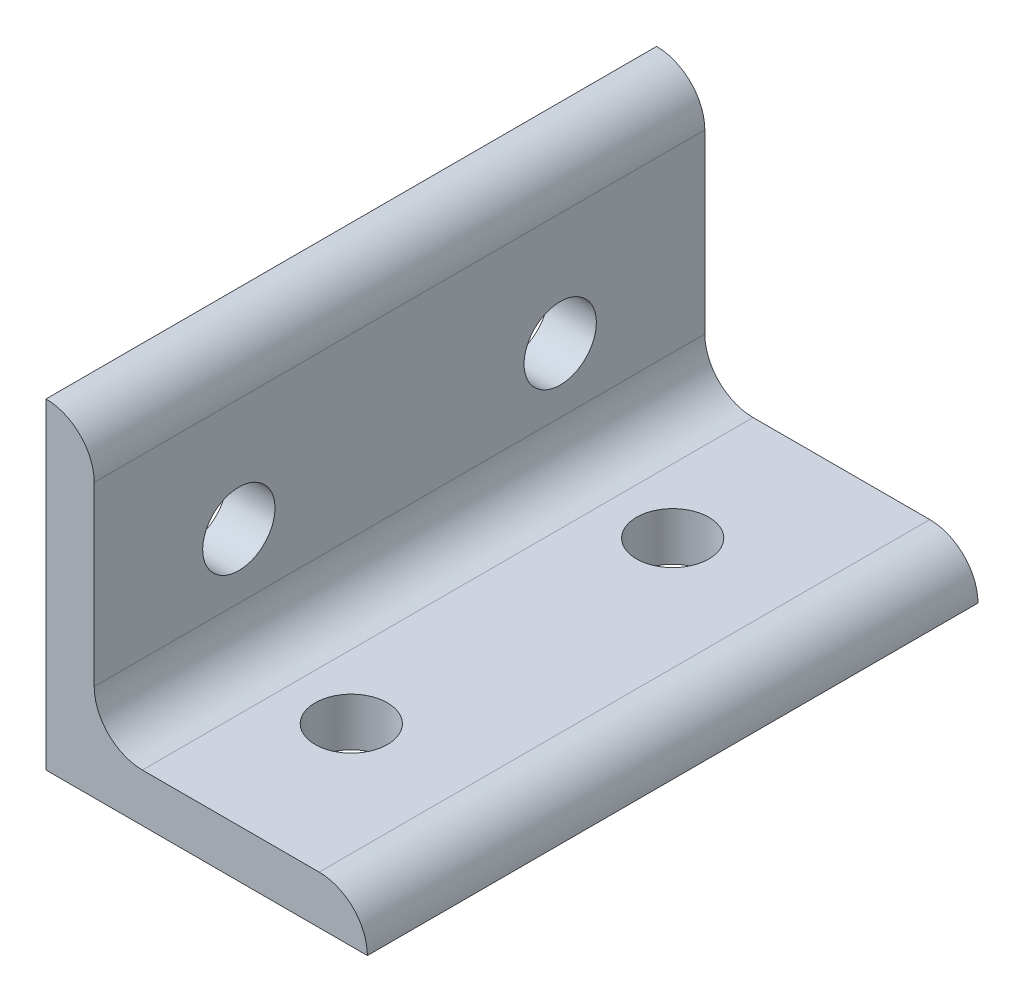
ISO-10303-21;
HEADER;
FILE_DESCRIPTION(('STEP AP214'),'2;1');
FILE_NAME('part.step','',(''),(''),'','','');
FILE_SCHEMA(('AUTOMOTIVE_DESIGN { 1 0 10303 214 1 1 1 1 }'));
ENDSEC;
DATA;
#1=APPLICATION_CONTEXT('core data for automotive mechanical design processes');
#2=APPLICATION_PROTOCOL_DEFINITION('international standard','automotive_design',2000,#1);
#3=PRODUCT_CONTEXT('',#1,'mechanical');
#4=PRODUCT('Part','Part','',(#3));
#5=PRODUCT_RELATED_PRODUCT_CATEGORY('part','',(#4));
#6=PRODUCT_DEFINITION_FORMATION('','',#4);
#7=PRODUCT_DEFINITION_CONTEXT('part definition',#1,'design');
#8=PRODUCT_DEFINITION('design','',#6,#7);
#9=PRODUCT_DEFINITION_SHAPE('','',#8);
#10=(LENGTH_UNIT() NAMED_UNIT(*) SI_UNIT(.MILLI.,.METRE.));
#11=(NAMED_UNIT(*) PLANE_ANGLE_UNIT() SI_UNIT($,.RADIAN.));
#12=(NAMED_UNIT(*) SI_UNIT($,.STERADIAN.) SOLID_ANGLE_UNIT());
#13=UNCERTAINTY_MEASURE_WITH_UNIT(LENGTH_MEASURE(1.E-05),#10,'distance_accuracy_value','');
#14=(GEOMETRIC_REPRESENTATION_CONTEXT(3) GLOBAL_UNCERTAINTY_ASSIGNED_CONTEXT((#13)) GLOBAL_UNIT_ASSIGNED_CONTEXT((#10,
#11,#12)) REPRESENTATION_CONTEXT('',''));
#15=CARTESIAN_POINT('',(0.,0.,0.));
#16=DIRECTION('',(0.,0.,1.));
#17=DIRECTION('',(1.,0.,0.));
#18=AXIS2_PLACEMENT_3D('',#15,#16,#17);
#19=CARTESIAN_POINT('',(6.,34.,38.));
#20=DIRECTION('',(-1.,0.,0.));
#21=DIRECTION('',(0.,-1.,0.));
#22=AXIS2_PLACEMENT_3D('',#19,#20,#21);
#23=PLANE('',#22);
#24=CARTESIAN_POINT('',(6.,20.,20.));
#25=DIRECTION('',(-1.,0.,0.));
#26=DIRECTION('',(0.,-1.,0.));
#27=AXIS2_PLACEMENT_3D('',#24,#25,#26);
#28=CIRCLE('',#27,4.5);
#29=CARTESIAN_POINT('',(6.,15.5,20.));
#30=VERTEX_POINT('',#29);
#31=EDGE_CURVE('E194',#30,#30,#28,.F.);
#32=ORIENTED_EDGE('',*,*,#31,.F.);
#33=EDGE_LOOP('',(#32));
#34=FACE_BOUND('',#33,.T.);
#35=DIRECTION('',(0.,1.,0.));
#36=VECTOR('',#35,1.);
#37=CARTESIAN_POINT('',(6.,34.,-38.));
#38=LINE('',#37,#36);
#39=CARTESIAN_POINT('',(6.,12.,-38.));
#40=VERTEX_POINT('',#39);
#41=CARTESIAN_POINT('',(6.,34.,-38.));
#42=VERTEX_POINT('',#41);
#43=EDGE_CURVE('E115',#40,#42,#38,.T.);
#44=ORIENTED_EDGE('',*,*,#43,.T.);
#45=DIRECTION('',(0.,0.,-1.));
#46=VECTOR('',#45,1.);
#47=CARTESIAN_POINT('',(6.,34.,38.));
#48=LINE('',#47,#46);
#49=CARTESIAN_POINT('',(6.,34.,38.));
#50=VERTEX_POINT('',#49);
#51=EDGE_CURVE('E112',#50,#42,#48,.T.);
#52=ORIENTED_EDGE('',*,*,#51,.F.);
#53=DIRECTION('',(0.,1.,0.));
#54=VECTOR('',#53,1.);
#55=CARTESIAN_POINT('',(6.,34.,38.));
#56=LINE('',#55,#54);
#57=CARTESIAN_POINT('',(6.,12.,38.));
#58=VERTEX_POINT('',#57);
#59=EDGE_CURVE('E101',#58,#50,#56,.T.);
#60=ORIENTED_EDGE('',*,*,#59,.F.);
#61=DIRECTION('',(0.,0.,-1.));
#62=VECTOR('',#61,1.);
#63=CARTESIAN_POINT('',(6.,12.,38.));
#64=LINE('',#63,#62);
#65=EDGE_CURVE('E116',#58,#40,#64,.T.);
#66=ORIENTED_EDGE('',*,*,#65,.T.);
#67=EDGE_LOOP('',(#44,#52,#60,#66));
#68=FACE_BOUND('',#67,.T.);
#69=CARTESIAN_POINT('',(6.,20.,-20.));
#70=DIRECTION('',(-1.,0.,0.));
#71=DIRECTION('',(0.,-1.,0.));
#72=AXIS2_PLACEMENT_3D('',#69,#70,#71);
#73=CIRCLE('',#72,4.5);
#74=CARTESIAN_POINT('',(6.,15.5,-20.));
#75=VERTEX_POINT('',#74);
#76=EDGE_CURVE('E187',#75,#75,#73,.F.);
#77=ORIENTED_EDGE('',*,*,#76,.F.);
#78=EDGE_LOOP('',(#77));
#79=FACE_BOUND('',#78,.T.);
#80=ADVANCED_FACE('F32',(#34,#68,#79),#23,.F.);
#81=CARTESIAN_POINT('',(0.,0.,38.));
#82=DIRECTION('',(1.,0.,0.));
#83=DIRECTION('',(0.,0.,-1.));
#84=AXIS2_PLACEMENT_3D('',#81,#82,#83);
#85=PLANE('',#84);
#86=CARTESIAN_POINT('',(0.,20.,20.));
#87=DIRECTION('',(1.,0.,0.));
#88=DIRECTION('',(0.,0.,-1.));
#89=AXIS2_PLACEMENT_3D('',#86,#87,#88);
#90=CIRCLE('',#89,4.5);
#91=CARTESIAN_POINT('',(0.,20.,15.5));
#92=VERTEX_POINT('',#91);
#93=EDGE_CURVE('E190',#92,#92,#90,.T.);
#94=ORIENTED_EDGE('',*,*,#93,.T.);
#95=EDGE_LOOP('',(#94));
#96=FACE_BOUND('',#95,.T.);
#97=DIRECTION('',(0.,-1.,0.));
#98=VECTOR('',#97,1.);
#99=CARTESIAN_POINT('',(0.,0.,-38.));
#100=LINE('',#99,#98);
#101=CARTESIAN_POINT('',(0.,40.,-38.));
#102=VERTEX_POINT('',#101);
#103=CARTESIAN_POINT('',(0.,0.,-38.));
#104=VERTEX_POINT('',#103);
#105=EDGE_CURVE('E83',#102,#104,#100,.T.);
#106=ORIENTED_EDGE('',*,*,#105,.T.);
#107=DIRECTION('',(0.,0.,-1.));
#108=VECTOR('',#107,1.);
#109=CARTESIAN_POINT('',(0.,0.,38.));
#110=LINE('',#109,#108);
#111=CARTESIAN_POINT('',(0.,0.,38.));
#112=VERTEX_POINT('',#111);
#113=EDGE_CURVE('E121',#112,#104,#110,.T.);
#114=ORIENTED_EDGE('',*,*,#113,.F.);
#115=DIRECTION('',(0.,-1.,0.));
#116=VECTOR('',#115,1.);
#117=CARTESIAN_POINT('',(0.,0.,38.));
#118=LINE('',#117,#116);
#119=CARTESIAN_POINT('',(0.,40.,38.));
#120=VERTEX_POINT('',#119);
#121=EDGE_CURVE('E51',#120,#112,#118,.T.);
#122=ORIENTED_EDGE('',*,*,#121,.F.);
#123=DIRECTION('',(0.,0.,-1.));
#124=VECTOR('',#123,1.);
#125=CARTESIAN_POINT('',(0.,40.,38.));
#126=LINE('',#125,#124);
#127=EDGE_CURVE('E117',#120,#102,#126,.T.);
#128=ORIENTED_EDGE('',*,*,#127,.T.);
#129=EDGE_LOOP('',(#106,#114,#122,#128));
#130=FACE_BOUND('',#129,.T.);
#131=CARTESIAN_POINT('',(0.,20.,-20.));
#132=DIRECTION('',(1.,0.,0.));
#133=DIRECTION('',(0.,0.,-1.));
#134=AXIS2_PLACEMENT_3D('',#131,#132,#133);
#135=CIRCLE('',#134,4.5);
#136=CARTESIAN_POINT('',(0.,20.,-24.5));
#137=VERTEX_POINT('',#136);
#138=EDGE_CURVE('E185',#137,#137,#135,.T.);
#139=ORIENTED_EDGE('',*,*,#138,.T.);
#140=EDGE_LOOP('',(#139));
#141=FACE_BOUND('',#140,.T.);
#142=ADVANCED_FACE('F178',(#96,#130,#141),#85,.F.);
#143=CARTESIAN_POINT('',(40.,0.,38.));
#144=DIRECTION('',(0.,1.,0.));
#145=DIRECTION('',(-1.,0.,0.));
#146=AXIS2_PLACEMENT_3D('',#143,#144,#145);
#147=PLANE('',#146);
#148=CARTESIAN_POINT('',(20.,0.,20.));
#149=DIRECTION('',(0.,1.,0.));
#150=DIRECTION('',(0.,0.,1.));
#151=AXIS2_PLACEMENT_3D('',#148,#149,#150);
#152=CIRCLE('',#151,4.5);
#153=CARTESIAN_POINT('',(20.,0.,24.5));
#154=VERTEX_POINT('',#153);
#155=EDGE_CURVE('E147',#154,#154,#152,.T.);
#156=ORIENTED_EDGE('',*,*,#155,.T.);
#157=EDGE_LOOP('',(#156));
#158=FACE_BOUND('',#157,.T.);
#159=DIRECTION('',(1.,0.,0.));
#160=VECTOR('',#159,1.);
#161=CARTESIAN_POINT('',(40.,0.,-38.));
#162=LINE('',#161,#160);
#163=CARTESIAN_POINT('',(40.,0.,-38.));
#164=VERTEX_POINT('',#163);
#165=EDGE_CURVE('E125',#104,#164,#162,.T.);
#166=ORIENTED_EDGE('',*,*,#165,.T.);
#167=DIRECTION('',(0.,0.,-1.));
#168=VECTOR('',#167,1.);
#169=CARTESIAN_POINT('',(40.,0.,38.));
#170=LINE('',#169,#168);
#171=CARTESIAN_POINT('',(40.,0.,38.));
#172=VERTEX_POINT('',#171);
#173=EDGE_CURVE('E11',#172,#164,#170,.T.);
#174=ORIENTED_EDGE('',*,*,#173,.F.);
#175=DIRECTION('',(1.,0.,0.));
#176=VECTOR('',#175,1.);
#177=CARTESIAN_POINT('',(40.,0.,38.));
#178=LINE('',#177,#176);
#179=EDGE_CURVE('E138',#112,#172,#178,.T.);
#180=ORIENTED_EDGE('',*,*,#179,.F.);
#181=ORIENTED_EDGE('',*,*,#113,.T.);
#182=EDGE_LOOP('',(#166,#174,#180,#181));
#183=FACE_BOUND('',#182,.T.);
#184=CARTESIAN_POINT('',(20.,0.,-20.));
#185=DIRECTION('',(0.,1.,0.));
#186=DIRECTION('',(0.,0.,1.));
#187=AXIS2_PLACEMENT_3D('',#184,#185,#186);
#188=CIRCLE('',#187,4.5);
#189=CARTESIAN_POINT('',(20.,0.,-15.5));
#190=VERTEX_POINT('',#189);
#191=EDGE_CURVE('E155',#190,#190,#188,.T.);
#192=ORIENTED_EDGE('',*,*,#191,.T.);
#193=EDGE_LOOP('',(#192));
#194=FACE_BOUND('',#193,.T.);
#195=ADVANCED_FACE('F34',(#158,#183,#194),#147,.F.);
#196=CARTESIAN_POINT('',(12.,6.,38.));
#197=DIRECTION('',(0.,-1.,0.));
#198=DIRECTION('',(0.,0.,-1.));
#199=AXIS2_PLACEMENT_3D('',#196,#197,#198);
#200=PLANE('',#199);
#201=CARTESIAN_POINT('',(20.,6.00000000000001,20.));
#202=DIRECTION('',(0.,-1.,0.));
#203=DIRECTION('',(0.,0.,-1.));
#204=AXIS2_PLACEMENT_3D('',#201,#202,#203);
#205=CIRCLE('',#204,4.5);
#206=CARTESIAN_POINT('',(20.,6.00000000000001,15.5));
#207=VERTEX_POINT('',#206);
#208=EDGE_CURVE('E129',#207,#207,#205,.F.);
#209=ORIENTED_EDGE('',*,*,#208,.F.);
#210=EDGE_LOOP('',(#209));
#211=FACE_BOUND('',#210,.T.);
#212=DIRECTION('',(-1.,0.,0.));
#213=VECTOR('',#212,1.);
#214=CARTESIAN_POINT('',(12.,6.,-38.));
#215=LINE('',#214,#213);
#216=CARTESIAN_POINT('',(34.,6.,-38.));
#217=VERTEX_POINT('',#216);
#218=CARTESIAN_POINT('',(12.,6.,-38.));
#219=VERTEX_POINT('',#218);
#220=EDGE_CURVE('E131',#217,#219,#215,.T.);
#221=ORIENTED_EDGE('',*,*,#220,.T.);
#222=DIRECTION('',(0.,0.,-1.));
#223=VECTOR('',#222,1.);
#224=CARTESIAN_POINT('',(12.,6.,38.));
#225=LINE('',#224,#223);
#226=CARTESIAN_POINT('',(12.,6.,38.));
#227=VERTEX_POINT('',#226);
#228=EDGE_CURVE('E142',#227,#219,#225,.T.);
#229=ORIENTED_EDGE('',*,*,#228,.F.);
#230=DIRECTION('',(-1.,0.,0.));
#231=VECTOR('',#230,1.);
#232=CARTESIAN_POINT('',(12.,6.,38.));
#233=LINE('',#232,#231);
#234=CARTESIAN_POINT('',(34.,6.,38.));
#235=VERTEX_POINT('',#234);
#236=EDGE_CURVE('E161',#235,#227,#233,.T.);
#237=ORIENTED_EDGE('',*,*,#236,.F.);
#238=DIRECTION('',(0.,0.,-1.));
#239=VECTOR('',#238,1.);
#240=CARTESIAN_POINT('',(34.,6.,38.));
#241=LINE('',#240,#239);
#242=EDGE_CURVE('E42',#235,#217,#241,.T.);
#243=ORIENTED_EDGE('',*,*,#242,.T.);
#244=EDGE_LOOP('',(#221,#229,#237,#243));
#245=FACE_BOUND('',#244,.T.);
#246=CARTESIAN_POINT('',(20.,6.00000000000001,-20.));
#247=DIRECTION('',(0.,-1.,0.));
#248=DIRECTION('',(0.,0.,-1.));
#249=AXIS2_PLACEMENT_3D('',#246,#247,#248);
#250=CIRCLE('',#249,4.5);
#251=CARTESIAN_POINT('',(20.,6.00000000000001,-24.5));
#252=VERTEX_POINT('',#251);
#253=EDGE_CURVE('E36',#252,#252,#250,.F.);
#254=ORIENTED_EDGE('',*,*,#253,.F.);
#255=EDGE_LOOP('',(#254));
#256=FACE_BOUND('',#255,.T.);
#257=ADVANCED_FACE('F165',(#211,#245,#256),#200,.F.);
#258=CARTESIAN_POINT('',(34.,0.,38.));
#259=DIRECTION('',(0.,0.,-1.));
#260=DIRECTION('',(-1.,0.,0.));
#261=AXIS2_PLACEMENT_3D('',#258,#259,#260);
#262=CYLINDRICAL_SURFACE('',#261,6.);
#263=CARTESIAN_POINT('',(34.,0.,-38.));
#264=DIRECTION('',(0.,0.,1.));
#265=DIRECTION('',(1.,0.,0.));
#266=AXIS2_PLACEMENT_3D('',#263,#264,#265);
#267=CIRCLE('',#266,6.);
#268=EDGE_CURVE('E128',#164,#217,#267,.T.);
#269=ORIENTED_EDGE('',*,*,#268,.T.);
#270=ORIENTED_EDGE('',*,*,#242,.F.);
#271=CARTESIAN_POINT('',(34.,0.,38.));
#272=DIRECTION('',(0.,0.,1.));
#273=DIRECTION('',(1.,0.,0.));
#274=AXIS2_PLACEMENT_3D('',#271,#272,#273);
#275=CIRCLE('',#274,6.);
#276=EDGE_CURVE('E91',#172,#235,#275,.T.);
#277=ORIENTED_EDGE('',*,*,#276,.F.);
#278=ORIENTED_EDGE('',*,*,#173,.T.);
#279=EDGE_LOOP('',(#269,#270,#277,#278));
#280=FACE_BOUND('',#279,.T.);
#281=ADVANCED_FACE('F209',(#280),#262,.T.);
#282=CARTESIAN_POINT('',(12.,12.,38.));
#283=DIRECTION('',(0.,0.,-1.));
#284=DIRECTION('',(-1.,0.,0.));
#285=AXIS2_PLACEMENT_3D('',#282,#283,#284);
#286=CYLINDRICAL_SURFACE('',#285,6.);
#287=CARTESIAN_POINT('',(12.,12.,-38.));
#288=DIRECTION('',(0.,0.,-1.));
#289=DIRECTION('',(1.,0.,0.));
#290=AXIS2_PLACEMENT_3D('',#287,#288,#289);
#291=CIRCLE('',#290,6.);
#292=EDGE_CURVE('E133',#219,#40,#291,.T.);
#293=ORIENTED_EDGE('',*,*,#292,.T.);
#294=ORIENTED_EDGE('',*,*,#65,.F.);
#295=CARTESIAN_POINT('',(12.,12.,38.));
#296=DIRECTION('',(0.,0.,-1.));
#297=DIRECTION('',(1.,0.,0.));
#298=AXIS2_PLACEMENT_3D('',#295,#296,#297);
#299=CIRCLE('',#298,6.);
#300=EDGE_CURVE('E107',#227,#58,#299,.T.);
#301=ORIENTED_EDGE('',*,*,#300,.F.);
#302=ORIENTED_EDGE('',*,*,#228,.T.);
#303=EDGE_LOOP('',(#293,#294,#301,#302));
#304=FACE_BOUND('',#303,.T.);
#305=ADVANCED_FACE('F170',(#304),#286,.F.);
#306=CARTESIAN_POINT('',(0.,34.,38.));
#307=DIRECTION('',(0.,0.,-1.));
#308=DIRECTION('',(-1.,0.,0.));
#309=AXIS2_PLACEMENT_3D('',#306,#307,#308);
#310=CYLINDRICAL_SURFACE('',#309,6.);
#311=CARTESIAN_POINT('',(0.,34.,-38.));
#312=DIRECTION('',(0.,0.,1.));
#313=DIRECTION('',(1.,0.,0.));
#314=AXIS2_PLACEMENT_3D('',#311,#312,#313);
#315=CIRCLE('',#314,6.);
#316=EDGE_CURVE('E77',#42,#102,#315,.T.);
#317=ORIENTED_EDGE('',*,*,#316,.T.);
#318=ORIENTED_EDGE('',*,*,#127,.F.);
#319=CARTESIAN_POINT('',(0.,34.,38.));
#320=DIRECTION('',(0.,0.,1.));
#321=DIRECTION('',(1.,0.,0.));
#322=AXIS2_PLACEMENT_3D('',#319,#320,#321);
#323=CIRCLE('',#322,6.);
#324=EDGE_CURVE('E105',#50,#120,#323,.T.);
#325=ORIENTED_EDGE('',*,*,#324,.F.);
#326=ORIENTED_EDGE('',*,*,#51,.T.);
#327=EDGE_LOOP('',(#317,#318,#325,#326));
#328=FACE_BOUND('',#327,.T.);
#329=ADVANCED_FACE('F119',(#328),#310,.T.);
#330=CARTESIAN_POINT('',(0.,34.,38.));
#331=DIRECTION('',(0.,0.,1.));
#332=DIRECTION('',(1.,0.,0.));
#333=AXIS2_PLACEMENT_3D('',#330,#331,#332);
#334=PLANE('',#333);
#335=ORIENTED_EDGE('',*,*,#179,.T.);
#336=ORIENTED_EDGE('',*,*,#276,.T.);
#337=ORIENTED_EDGE('',*,*,#236,.T.);
#338=ORIENTED_EDGE('',*,*,#300,.T.);
#339=ORIENTED_EDGE('',*,*,#59,.T.);
#340=ORIENTED_EDGE('',*,*,#324,.T.);
#341=ORIENTED_EDGE('',*,*,#121,.T.);
#342=EDGE_LOOP('',(#335,#336,#337,#338,#339,#340,#341));
#343=FACE_BOUND('',#342,.T.);
#344=ADVANCED_FACE('F103',(#343),#334,.T.);
#345=CARTESIAN_POINT('',(0.,34.,-38.));
#346=DIRECTION('',(0.,0.,1.));
#347=DIRECTION('',(1.,0.,0.));
#348=AXIS2_PLACEMENT_3D('',#345,#346,#347);
#349=PLANE('',#348);
#350=ORIENTED_EDGE('',*,*,#165,.F.);
#351=ORIENTED_EDGE('',*,*,#105,.F.);
#352=ORIENTED_EDGE('',*,*,#316,.F.);
#353=ORIENTED_EDGE('',*,*,#43,.F.);
#354=ORIENTED_EDGE('',*,*,#292,.F.);
#355=ORIENTED_EDGE('',*,*,#220,.F.);
#356=ORIENTED_EDGE('',*,*,#268,.F.);
#357=EDGE_LOOP('',(#350,#351,#352,#353,#354,#355,#356));
#358=FACE_BOUND('',#357,.T.);
#359=ADVANCED_FACE('F173',(#358),#349,.F.);
#360=CARTESIAN_POINT('',(20.,40.,20.));
#361=DIRECTION('',(0.,-1.,0.));
#362=DIRECTION('',(0.,0.,-1.));
#363=AXIS2_PLACEMENT_3D('',#360,#361,#362);
#364=CYLINDRICAL_SURFACE('',#363,4.5);
#365=ORIENTED_EDGE('',*,*,#155,.F.);
#366=EDGE_LOOP('',(#365));
#367=FACE_BOUND('',#366,.T.);
#368=ORIENTED_EDGE('',*,*,#208,.T.);
#369=EDGE_LOOP('',(#368));
#370=FACE_BOUND('',#369,.T.);
#371=ADVANCED_FACE('F205',(#367,#370),#364,.F.);
#372=CARTESIAN_POINT('',(20.,40.,-20.));
#373=DIRECTION('',(0.,-1.,0.));
#374=DIRECTION('',(0.,0.,-1.));
#375=AXIS2_PLACEMENT_3D('',#372,#373,#374);
#376=CYLINDRICAL_SURFACE('',#375,4.5);
#377=ORIENTED_EDGE('',*,*,#191,.F.);
#378=EDGE_LOOP('',(#377));
#379=FACE_BOUND('',#378,.T.);
#380=ORIENTED_EDGE('',*,*,#253,.T.);
#381=EDGE_LOOP('',(#380));
#382=FACE_BOUND('',#381,.T.);
#383=ADVANCED_FACE('F201',(#379,#382),#376,.F.);
#384=CARTESIAN_POINT('',(40.,20.,20.));
#385=DIRECTION('',(-1.,0.,0.));
#386=DIRECTION('',(0.,0.,1.));
#387=AXIS2_PLACEMENT_3D('',#384,#385,#386);
#388=CYLINDRICAL_SURFACE('',#387,4.5);
#389=ORIENTED_EDGE('',*,*,#93,.F.);
#390=EDGE_LOOP('',(#389));
#391=FACE_BOUND('',#390,.T.);
#392=ORIENTED_EDGE('',*,*,#31,.T.);
#393=EDGE_LOOP('',(#392));
#394=FACE_BOUND('',#393,.T.);
#395=ADVANCED_FACE('F204',(#391,#394),#388,.F.);
#396=CARTESIAN_POINT('',(40.,20.,-20.));
#397=DIRECTION('',(-1.,0.,0.));
#398=DIRECTION('',(0.,0.,1.));
#399=AXIS2_PLACEMENT_3D('',#396,#397,#398);
#400=CYLINDRICAL_SURFACE('',#399,4.5);
#401=ORIENTED_EDGE('',*,*,#138,.F.);
#402=EDGE_LOOP('',(#401));
#403=FACE_BOUND('',#402,.T.);
#404=ORIENTED_EDGE('',*,*,#76,.T.);
#405=EDGE_LOOP('',(#404));
#406=FACE_BOUND('',#405,.T.);
#407=ADVANCED_FACE('F241',(#403,#406),#400,.F.);
#408=CLOSED_SHELL('',(#80,#142,#195,#257,#281,#305,#329,#344,#359,#371,#383,#395,#407));
#409=MANIFOLD_SOLID_BREP('B2',#408);
#410=ADVANCED_BREP_SHAPE_REPRESENTATION('',(#18,#409),#14);
#411=SHAPE_DEFINITION_REPRESENTATION(#9,#410);
ENDSEC;
END-ISO-10303-21;
